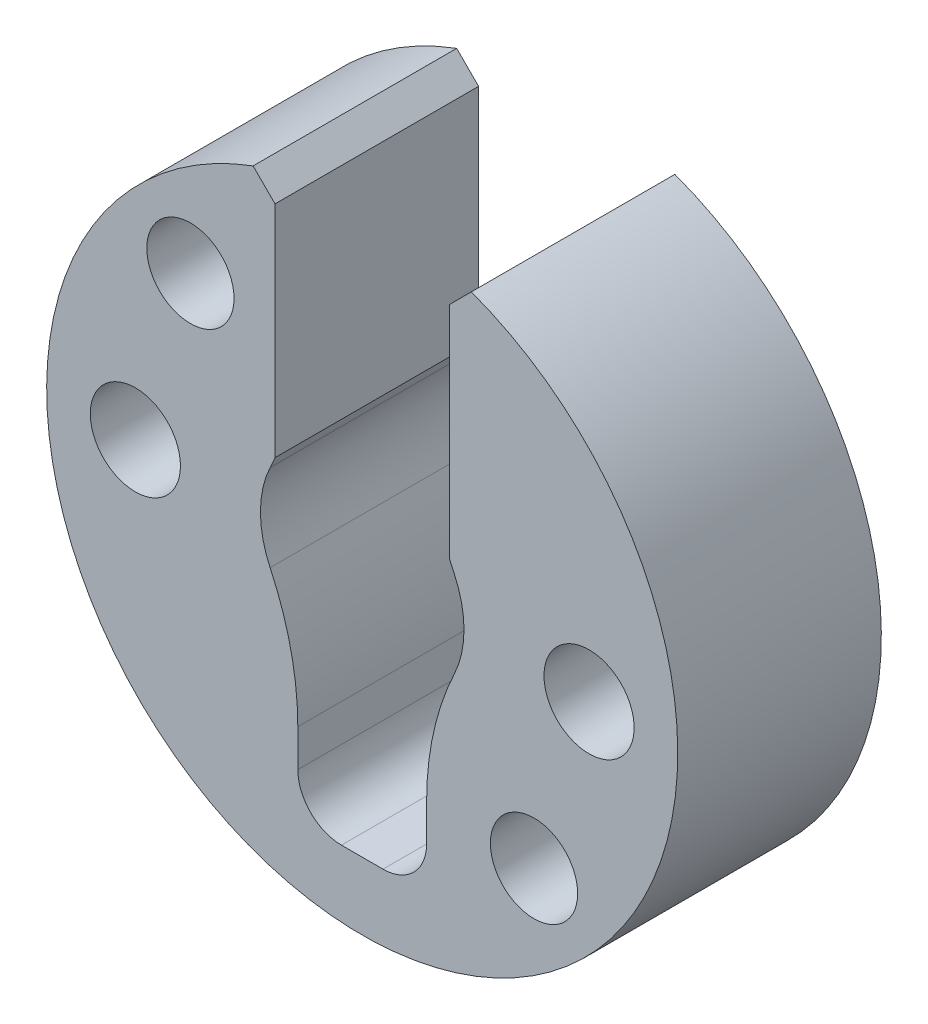
ISO-10303-21;
HEADER;
FILE_DESCRIPTION(('STEP AP214'),'2;1');
FILE_NAME('part.step','',(''),(''),'','','');
FILE_SCHEMA(('AUTOMOTIVE_DESIGN { 1 0 10303 214 1 1 1 1 }'));
ENDSEC;
DATA;
#1=APPLICATION_CONTEXT('core data for automotive mechanical design processes');
#2=APPLICATION_PROTOCOL_DEFINITION('international standard','automotive_design',2000,#1);
#3=PRODUCT_CONTEXT('',#1,'mechanical');
#4=PRODUCT('Part','Part','',(#3));
#5=PRODUCT_RELATED_PRODUCT_CATEGORY('part','',(#4));
#6=PRODUCT_DEFINITION_FORMATION('','',#4);
#7=PRODUCT_DEFINITION_CONTEXT('part definition',#1,'design');
#8=PRODUCT_DEFINITION('design','',#6,#7);
#9=PRODUCT_DEFINITION_SHAPE('','',#8);
#10=(LENGTH_UNIT() NAMED_UNIT(*) SI_UNIT(.MILLI.,.METRE.));
#11=(NAMED_UNIT(*) PLANE_ANGLE_UNIT() SI_UNIT($,.RADIAN.));
#12=(NAMED_UNIT(*) SI_UNIT($,.STERADIAN.) SOLID_ANGLE_UNIT());
#13=UNCERTAINTY_MEASURE_WITH_UNIT(LENGTH_MEASURE(1.E-05),#10,'distance_accuracy_value','');
#14=(GEOMETRIC_REPRESENTATION_CONTEXT(3) GLOBAL_UNCERTAINTY_ASSIGNED_CONTEXT((#13)) GLOBAL_UNIT_ASSIGNED_CONTEXT((#10,
#11,#12)) REPRESENTATION_CONTEXT('',''));
#15=CARTESIAN_POINT('',(0.,0.,0.));
#16=DIRECTION('',(0.,0.,1.));
#17=DIRECTION('',(1.,0.,0.));
#18=AXIS2_PLACEMENT_3D('',#15,#16,#17);
#19=CARTESIAN_POINT('',(-7.80000000000021,2.15074260103718E-13,7.));
#20=DIRECTION('',(0.,0.,-1.));
#21=DIRECTION('',(-1.,0.,0.));
#22=AXIS2_PLACEMENT_3D('',#19,#20,#21);
#23=CYLINDRICAL_SURFACE('',#22,1.55);
#24=CARTESIAN_POINT('',(-7.80000000000021,2.15074260103718E-13,7.));
#25=DIRECTION('',(0.,0.,1.));
#26=DIRECTION('',(1.,0.,0.));
#27=AXIS2_PLACEMENT_3D('',#24,#25,#26);
#28=CIRCLE('',#27,1.55);
#29=CARTESIAN_POINT('',(-6.25000000000021,2.15074260103718E-13,7.));
#30=VERTEX_POINT('',#29);
#31=EDGE_CURVE('E230',#30,#30,#28,.T.);
#32=ORIENTED_EDGE('',*,*,#31,.T.);
#33=EDGE_LOOP('',(#32));
#34=FACE_BOUND('',#33,.T.);
#35=CARTESIAN_POINT('',(-7.80000000000021,2.15074260103718E-13,2.5));
#36=DIRECTION('',(0.,0.,-1.));
#37=DIRECTION('',(-1.,0.,0.));
#38=AXIS2_PLACEMENT_3D('',#35,#36,#37);
#39=CIRCLE('',#38,1.55);
#40=CARTESIAN_POINT('',(-9.35000000000022,2.15074260103718E-13,2.5));
#41=VERTEX_POINT('',#40);
#42=EDGE_CURVE('E354',#41,#41,#39,.T.);
#43=ORIENTED_EDGE('',*,*,#42,.T.);
#44=EDGE_LOOP('',(#43));
#45=FACE_BOUND('',#44,.T.);
#46=ADVANCED_FACE('F39',(#34,#45),#23,.F.);
#47=CARTESIAN_POINT('',(7.80000000000021,2.15074260103718E-13,7.));
#48=DIRECTION('',(0.,0.,-1.));
#49=DIRECTION('',(-1.,0.,0.));
#50=AXIS2_PLACEMENT_3D('',#47,#48,#49);
#51=CYLINDRICAL_SURFACE('',#50,1.55);
#52=CARTESIAN_POINT('',(7.80000000000021,2.15074260103718E-13,7.));
#53=DIRECTION('',(0.,0.,1.));
#54=DIRECTION('',(-1.,0.,0.));
#55=AXIS2_PLACEMENT_3D('',#52,#53,#54);
#56=CIRCLE('',#55,1.55);
#57=CARTESIAN_POINT('',(6.25000000000021,2.15074260103718E-13,7.));
#58=VERTEX_POINT('',#57);
#59=EDGE_CURVE('E199',#58,#58,#56,.T.);
#60=ORIENTED_EDGE('',*,*,#59,.T.);
#61=EDGE_LOOP('',(#60));
#62=FACE_BOUND('',#61,.T.);
#63=CARTESIAN_POINT('',(7.80000000000021,2.15074260103718E-13,2.5));
#64=DIRECTION('',(0.,0.,-1.));
#65=DIRECTION('',(-1.,0.,0.));
#66=AXIS2_PLACEMENT_3D('',#63,#64,#65);
#67=CIRCLE('',#66,1.55);
#68=CARTESIAN_POINT('',(6.25000000000021,2.15074260103718E-13,2.5));
#69=VERTEX_POINT('',#68);
#70=EDGE_CURVE('E358',#69,#69,#67,.T.);
#71=ORIENTED_EDGE('',*,*,#70,.T.);
#72=EDGE_LOOP('',(#71));
#73=FACE_BOUND('',#72,.T.);
#74=ADVANCED_FACE('F436',(#62,#73),#51,.F.);
#75=CARTESIAN_POINT('',(0.,0.,7.));
#76=DIRECTION('',(0.,0.,1.));
#77=DIRECTION('',(1.,0.,0.));
#78=AXIS2_PLACEMENT_3D('',#75,#76,#77);
#79=PLANE('',#78);
#80=CARTESIAN_POINT('',(-5.90720439833731,5.90720439833729,7.));
#81=DIRECTION('',(0.,0.,1.));
#82=DIRECTION('',(1.,0.,0.));
#83=AXIS2_PLACEMENT_3D('',#80,#81,#82);
#84=CIRCLE('',#83,1.5);
#85=CARTESIAN_POINT('',(-4.40720439833731,5.90720439833729,7.));
#86=VERTEX_POINT('',#85);
#87=EDGE_CURVE('E174',#86,#86,#84,.T.);
#88=ORIENTED_EDGE('',*,*,#87,.F.);
#89=EDGE_LOOP('',(#88));
#90=FACE_BOUND('',#89,.T.);
#91=CARTESIAN_POINT('',(5.90720439833733,-5.90720439833726,7.));
#92=DIRECTION('',(0.,0.,1.));
#93=DIRECTION('',(-1.,0.,0.));
#94=AXIS2_PLACEMENT_3D('',#91,#92,#93);
#95=CIRCLE('',#94,1.5);
#96=CARTESIAN_POINT('',(4.40720439833733,-5.90720439833726,7.));
#97=VERTEX_POINT('',#96);
#98=EDGE_CURVE('E656',#97,#97,#95,.T.);
#99=ORIENTED_EDGE('',*,*,#98,.F.);
#100=EDGE_LOOP('',(#99));
#101=FACE_BOUND('',#100,.T.);
#102=CARTESIAN_POINT('',(0.,0.,7.));
#103=DIRECTION('',(0.,0.,1.));
#104=DIRECTION('',(1.,0.,0.));
#105=AXIS2_PLACEMENT_3D('',#102,#103,#104);
#106=CIRCLE('',#105,10.85);
#107=CARTESIAN_POINT('',(-3.7512584292562,10.1808919155904,7.));
#108=VERTEX_POINT('',#107);
#109=CARTESIAN_POINT('',(3.7512584292562,10.1808919155904,7.));
#110=VERTEX_POINT('',#109);
#111=EDGE_CURVE('E235',#108,#110,#106,.T.);
#112=ORIENTED_EDGE('',*,*,#111,.T.);
#113=DIRECTION('',(-0.707106781186545,-0.70710678118655,0.));
#114=VECTOR('',#113,1.);
#115=CARTESIAN_POINT('',(-3.2148167431671,3.21481674316708,7.));
#116=LINE('',#115,#114);
#117=CARTESIAN_POINT('',(2.99796111437333,9.42759460070755,7.));
#118=VERTEX_POINT('',#117);
#119=EDGE_CURVE('E171',#110,#118,#116,.T.);
#120=ORIENTED_EDGE('',*,*,#119,.T.);
#121=DIRECTION('',(0.,1.,0.));
#122=VECTOR('',#121,1.);
#123=CARTESIAN_POINT('',(2.99796111437333,0.,7.));
#124=LINE('',#123,#122);
#125=CARTESIAN_POINT('',(2.99796111437333,1.86931869307852,7.));
#126=VERTEX_POINT('',#125);
#127=EDGE_CURVE('E155',#126,#118,#124,.T.);
#128=ORIENTED_EDGE('',*,*,#127,.F.);
#129=CARTESIAN_POINT('',(12.2145602188089,5.74930592863963,7.));
#130=DIRECTION('',(0.,0.,-1.));
#131=DIRECTION('',(-1.,0.,0.));
#132=AXIS2_PLACEMENT_3D('',#129,#130,#131);
#133=CIRCLE('',#132,10.);
#134=CARTESIAN_POINT('',(3.16673783450601,1.49056079631398,7.));
#135=VERTEX_POINT('',#134);
#136=EDGE_CURVE('E170',#135,#126,#133,.T.);
#137=ORIENTED_EDGE('',*,*,#136,.F.);
#138=CARTESIAN_POINT('',(0.,0.,7.));
#139=DIRECTION('',(0.,0.,1.));
#140=DIRECTION('',(1.,0.,0.));
#141=AXIS2_PLACEMENT_3D('',#138,#139,#140);
#142=CIRCLE('',#141,3.5);
#143=CARTESIAN_POINT('',(3.16673783450601,-1.49056079631398,7.));
#144=VERTEX_POINT('',#143);
#145=EDGE_CURVE('E182',#144,#135,#142,.T.);
#146=ORIENTED_EDGE('',*,*,#145,.F.);
#147=CARTESIAN_POINT('',(12.2145602188089,-5.74930592863963,7.));
#148=DIRECTION('',(0.,0.,-1.));
#149=DIRECTION('',(-1.,0.,0.));
#150=AXIS2_PLACEMENT_3D('',#147,#148,#149);
#151=CIRCLE('',#150,10.);
#152=CARTESIAN_POINT('',(2.21456021880891,-5.74930592863963,7.));
#153=VERTEX_POINT('',#152);
#154=EDGE_CURVE('E188',#153,#144,#151,.T.);
#155=ORIENTED_EDGE('',*,*,#154,.F.);
#156=DIRECTION('',(0.,1.,0.));
#157=VECTOR('',#156,1.);
#158=CARTESIAN_POINT('',(2.21456021880891,-5.74930592863963,7.));
#159=LINE('',#158,#157);
#160=CARTESIAN_POINT('',(2.21456021880891,-7.02720331189542,7.));
#161=VERTEX_POINT('',#160);
#162=EDGE_CURVE('E384',#161,#153,#159,.T.);
#163=ORIENTED_EDGE('',*,*,#162,.F.);
#164=CARTESIAN_POINT('',(0.714560218808913,-7.02720331189542,7.));
#165=DIRECTION('',(0.,0.,1.));
#166=DIRECTION('',(-1.,0.,0.));
#167=AXIS2_PLACEMENT_3D('',#164,#165,#166);
#168=CIRCLE('',#167,1.5);
#169=CARTESIAN_POINT('',(0.714560218808913,-8.52720331189542,7.));
#170=VERTEX_POINT('',#169);
#171=EDGE_CURVE('E380',#170,#161,#168,.T.);
#172=ORIENTED_EDGE('',*,*,#171,.F.);
#173=DIRECTION('',(1.,0.,0.));
#174=VECTOR('',#173,1.);
#175=CARTESIAN_POINT('',(-0.714560218808913,-8.52720331189542,7.));
#176=LINE('',#175,#174);
#177=CARTESIAN_POINT('',(-0.714560218808912,-8.52720331189542,7.));
#178=VERTEX_POINT('',#177);
#179=EDGE_CURVE('E376',#178,#170,#176,.T.);
#180=ORIENTED_EDGE('',*,*,#179,.F.);
#181=CARTESIAN_POINT('',(-0.714560218808913,-7.02720331189542,7.));
#182=DIRECTION('',(0.,0.,1.));
#183=DIRECTION('',(-1.,0.,0.));
#184=AXIS2_PLACEMENT_3D('',#181,#182,#183);
#185=CIRCLE('',#184,1.5);
#186=CARTESIAN_POINT('',(-2.21456021880891,-7.02720331189542,7.));
#187=VERTEX_POINT('',#186);
#188=EDGE_CURVE('E372',#187,#178,#185,.T.);
#189=ORIENTED_EDGE('',*,*,#188,.F.);
#190=DIRECTION('',(0.,-1.,0.));
#191=VECTOR('',#190,1.);
#192=CARTESIAN_POINT('',(-2.21456021880891,-5.74930592863963,7.));
#193=LINE('',#192,#191);
#194=CARTESIAN_POINT('',(-2.21456021880891,-5.74930592863963,7.));
#195=VERTEX_POINT('',#194);
#196=EDGE_CURVE('E368',#195,#187,#193,.T.);
#197=ORIENTED_EDGE('',*,*,#196,.F.);
#198=CARTESIAN_POINT('',(-12.2145602188089,-5.74930592863963,7.));
#199=DIRECTION('',(0.,0.,-1.));
#200=DIRECTION('',(1.,0.,0.));
#201=AXIS2_PLACEMENT_3D('',#198,#199,#200);
#202=CIRCLE('',#201,10.);
#203=CARTESIAN_POINT('',(-3.16673783450601,-1.49056079631398,7.));
#204=VERTEX_POINT('',#203);
#205=EDGE_CURVE('E365',#204,#195,#202,.T.);
#206=ORIENTED_EDGE('',*,*,#205,.F.);
#207=CARTESIAN_POINT('',(0.,0.,7.));
#208=DIRECTION('',(0.,0.,1.));
#209=DIRECTION('',(1.,0.,0.));
#210=AXIS2_PLACEMENT_3D('',#207,#208,#209);
#211=CIRCLE('',#210,3.5);
#212=CARTESIAN_POINT('',(-3.16673783450601,1.49056079631398,7.));
#213=VERTEX_POINT('',#212);
#214=EDGE_CURVE('E186',#213,#204,#211,.T.);
#215=ORIENTED_EDGE('',*,*,#214,.F.);
#216=CARTESIAN_POINT('',(-12.2145602188089,5.74930592863962,7.));
#217=DIRECTION('',(0.,0.,-1.));
#218=DIRECTION('',(-1.,0.,0.));
#219=AXIS2_PLACEMENT_3D('',#216,#217,#218);
#220=CIRCLE('',#219,10.);
#221=CARTESIAN_POINT('',(-2.99796111437333,1.86931869307851,7.));
#222=VERTEX_POINT('',#221);
#223=EDGE_CURVE('E181',#222,#213,#220,.T.);
#224=ORIENTED_EDGE('',*,*,#223,.F.);
#225=DIRECTION('',(0.,-1.,0.));
#226=VECTOR('',#225,1.);
#227=CARTESIAN_POINT('',(-2.99796111437333,0.,7.));
#228=LINE('',#227,#226);
#229=CARTESIAN_POINT('',(-2.99796111437333,9.42759460070755,7.));
#230=VERTEX_POINT('',#229);
#231=EDGE_CURVE('E173',#230,#222,#228,.T.);
#232=ORIENTED_EDGE('',*,*,#231,.F.);
#233=DIRECTION('',(0.707106781186545,-0.70710678118655,0.));
#234=VECTOR('',#233,1.);
#235=CARTESIAN_POINT('',(3.2148167431671,3.21481674316708,7.));
#236=LINE('',#235,#234);
#237=EDGE_CURVE('E293',#230,#108,#236,.F.);
#238=ORIENTED_EDGE('',*,*,#237,.T.);
#239=EDGE_LOOP('',(#112,#120,#128,#137,#146,#155,#163,#172,#180,#189,#197,#206,#215,#224,#232,#238));
#240=FACE_BOUND('',#239,.T.);
#241=ORIENTED_EDGE('',*,*,#31,.F.);
#242=EDGE_LOOP('',(#241));
#243=FACE_BOUND('',#242,.T.);
#244=ORIENTED_EDGE('',*,*,#59,.F.);
#245=EDGE_LOOP('',(#244));
#246=FACE_BOUND('',#245,.T.);
#247=ADVANCED_FACE('F167',(#90,#101,#240,#243,#246),#79,.T.);
#248=CARTESIAN_POINT('',(0.,0.,0.));
#249=DIRECTION('',(0.,0.,1.));
#250=DIRECTION('',(1.,0.,0.));
#251=AXIS2_PLACEMENT_3D('',#248,#249,#250);
#252=PLANE('',#251);
#253=CARTESIAN_POINT('',(-5.90720439833731,5.90720439833729,0.));
#254=DIRECTION('',(0.,0.,1.));
#255=DIRECTION('',(1.,0.,0.));
#256=AXIS2_PLACEMENT_3D('',#253,#254,#255);
#257=CIRCLE('',#256,2.);
#258=CARTESIAN_POINT('',(-3.90720439833731,5.90720439833729,0.));
#259=VERTEX_POINT('',#258);
#260=EDGE_CURVE('E312',#259,#259,#257,.T.);
#261=ORIENTED_EDGE('',*,*,#260,.T.);
#262=EDGE_LOOP('',(#261));
#263=FACE_BOUND('',#262,.T.);
#264=CARTESIAN_POINT('',(5.90720439833733,-5.90720439833726,0.));
#265=DIRECTION('',(0.,0.,1.));
#266=DIRECTION('',(1.,0.,0.));
#267=AXIS2_PLACEMENT_3D('',#264,#265,#266);
#268=CIRCLE('',#267,2.);
#269=CARTESIAN_POINT('',(7.90720439833733,-5.90720439833726,0.));
#270=VERTEX_POINT('',#269);
#271=EDGE_CURVE('E308',#270,#270,#268,.T.);
#272=ORIENTED_EDGE('',*,*,#271,.T.);
#273=EDGE_LOOP('',(#272));
#274=FACE_BOUND('',#273,.T.);
#275=DIRECTION('',(0.,1.,0.));
#276=VECTOR('',#275,1.);
#277=CARTESIAN_POINT('',(2.99796111437333,0.,0.));
#278=LINE('',#277,#276);
#279=CARTESIAN_POINT('',(2.99796111437333,1.86931869307852,0.));
#280=VERTEX_POINT('',#279);
#281=CARTESIAN_POINT('',(2.99796111437333,9.42759460070755,0.));
#282=VERTEX_POINT('',#281);
#283=EDGE_CURVE('E156',#280,#282,#278,.T.);
#284=ORIENTED_EDGE('',*,*,#283,.T.);
#285=DIRECTION('',(0.707106781186545,0.70710678118655,0.));
#286=VECTOR('',#285,1.);
#287=CARTESIAN_POINT('',(3.7512584292562,10.1808919155904,0.));
#288=LINE('',#287,#286);
#289=CARTESIAN_POINT('',(3.7512584292562,10.1808919155904,0.));
#290=VERTEX_POINT('',#289);
#291=EDGE_CURVE('E302',#282,#290,#288,.T.);
#292=ORIENTED_EDGE('',*,*,#291,.T.);
#293=CARTESIAN_POINT('',(0.,0.,0.));
#294=DIRECTION('',(0.,0.,1.));
#295=DIRECTION('',(1.,0.,0.));
#296=AXIS2_PLACEMENT_3D('',#293,#294,#295);
#297=CIRCLE('',#296,10.85);
#298=CARTESIAN_POINT('',(-3.7512584292562,10.1808919155904,0.));
#299=VERTEX_POINT('',#298);
#300=EDGE_CURVE('E234',#299,#290,#297,.T.);
#301=ORIENTED_EDGE('',*,*,#300,.F.);
#302=DIRECTION('',(-0.707106781186545,0.70710678118655,0.));
#303=VECTOR('',#302,1.);
#304=CARTESIAN_POINT('',(-3.7512584292562,10.1808919155904,0.));
#305=LINE('',#304,#303);
#306=CARTESIAN_POINT('',(-2.99796111437333,9.42759460070755,0.));
#307=VERTEX_POINT('',#306);
#308=EDGE_CURVE('E55',#299,#307,#305,.F.);
#309=ORIENTED_EDGE('',*,*,#308,.T.);
#310=DIRECTION('',(0.,-1.,0.));
#311=VECTOR('',#310,1.);
#312=CARTESIAN_POINT('',(-2.99796111437333,0.,0.));
#313=LINE('',#312,#311);
#314=CARTESIAN_POINT('',(-2.99796111437333,1.86931869307851,0.));
#315=VERTEX_POINT('',#314);
#316=EDGE_CURVE('E335',#307,#315,#313,.T.);
#317=ORIENTED_EDGE('',*,*,#316,.T.);
#318=CARTESIAN_POINT('',(-12.2145602188089,5.74930592863962,0.));
#319=DIRECTION('',(0.,0.,1.));
#320=DIRECTION('',(1.,0.,0.));
#321=AXIS2_PLACEMENT_3D('',#318,#319,#320);
#322=CIRCLE('',#321,10.);
#323=CARTESIAN_POINT('',(-3.16673783450601,1.49056079631398,0.));
#324=VERTEX_POINT('',#323);
#325=EDGE_CURVE('E272',#315,#324,#322,.F.);
#326=ORIENTED_EDGE('',*,*,#325,.T.);
#327=CARTESIAN_POINT('',(0.,0.,0.));
#328=DIRECTION('',(0.,0.,1.));
#329=DIRECTION('',(1.,0.,0.));
#330=AXIS2_PLACEMENT_3D('',#327,#328,#329);
#331=CIRCLE('',#330,3.5);
#332=CARTESIAN_POINT('',(-3.16673783450601,-1.49056079631398,0.));
#333=VERTEX_POINT('',#332);
#334=EDGE_CURVE('E275',#324,#333,#331,.T.);
#335=ORIENTED_EDGE('',*,*,#334,.T.);
#336=CARTESIAN_POINT('',(-12.2145602188089,-5.74930592863963,0.));
#337=DIRECTION('',(0.,0.,1.));
#338=DIRECTION('',(1.,0.,0.));
#339=AXIS2_PLACEMENT_3D('',#336,#337,#338);
#340=CIRCLE('',#339,10.);
#341=CARTESIAN_POINT('',(-2.21456021880891,-5.74930592863963,0.));
#342=VERTEX_POINT('',#341);
#343=EDGE_CURVE('E162',#333,#342,#340,.F.);
#344=ORIENTED_EDGE('',*,*,#343,.T.);
#345=DIRECTION('',(0.,-1.,0.));
#346=VECTOR('',#345,1.);
#347=CARTESIAN_POINT('',(-2.21456021880892,0.,0.));
#348=LINE('',#347,#346);
#349=CARTESIAN_POINT('',(-2.21456021880891,-7.02720331189542,0.));
#350=VERTEX_POINT('',#349);
#351=EDGE_CURVE('E238',#342,#350,#348,.T.);
#352=ORIENTED_EDGE('',*,*,#351,.T.);
#353=CARTESIAN_POINT('',(-0.714560218808913,-7.02720331189542,0.));
#354=DIRECTION('',(0.,0.,1.));
#355=DIRECTION('',(1.,0.,0.));
#356=AXIS2_PLACEMENT_3D('',#353,#354,#355);
#357=CIRCLE('',#356,1.5);
#358=CARTESIAN_POINT('',(-0.714560218808912,-8.52720331189542,0.));
#359=VERTEX_POINT('',#358);
#360=EDGE_CURVE('E245',#350,#359,#357,.T.);
#361=ORIENTED_EDGE('',*,*,#360,.T.);
#362=DIRECTION('',(1.,0.,0.));
#363=VECTOR('',#362,1.);
#364=CARTESIAN_POINT('',(0.,-8.52720331189542,0.));
#365=LINE('',#364,#363);
#366=CARTESIAN_POINT('',(0.714560218808913,-8.52720331189542,0.));
#367=VERTEX_POINT('',#366);
#368=EDGE_CURVE('E249',#359,#367,#365,.T.);
#369=ORIENTED_EDGE('',*,*,#368,.T.);
#370=CARTESIAN_POINT('',(0.714560218808913,-7.02720331189542,0.));
#371=DIRECTION('',(0.,0.,1.));
#372=DIRECTION('',(1.,0.,0.));
#373=AXIS2_PLACEMENT_3D('',#370,#371,#372);
#374=CIRCLE('',#373,1.5);
#375=CARTESIAN_POINT('',(2.21456021880891,-7.02720331189542,0.));
#376=VERTEX_POINT('',#375);
#377=EDGE_CURVE('E253',#367,#376,#374,.T.);
#378=ORIENTED_EDGE('',*,*,#377,.T.);
#379=DIRECTION('',(0.,1.,0.));
#380=VECTOR('',#379,1.);
#381=CARTESIAN_POINT('',(2.21456021880891,0.,0.));
#382=LINE('',#381,#380);
#383=CARTESIAN_POINT('',(2.21456021880891,-5.74930592863963,0.));
#384=VERTEX_POINT('',#383);
#385=EDGE_CURVE('E257',#376,#384,#382,.T.);
#386=ORIENTED_EDGE('',*,*,#385,.T.);
#387=CARTESIAN_POINT('',(12.2145602188089,-5.74930592863963,0.));
#388=DIRECTION('',(0.,0.,1.));
#389=DIRECTION('',(1.,0.,0.));
#390=AXIS2_PLACEMENT_3D('',#387,#388,#389);
#391=CIRCLE('',#390,10.);
#392=CARTESIAN_POINT('',(3.16673783450601,-1.49056079631398,0.));
#393=VERTEX_POINT('',#392);
#394=EDGE_CURVE('E261',#384,#393,#391,.F.);
#395=ORIENTED_EDGE('',*,*,#394,.T.);
#396=CARTESIAN_POINT('',(0.,0.,0.));
#397=DIRECTION('',(0.,0.,1.));
#398=DIRECTION('',(1.,0.,0.));
#399=AXIS2_PLACEMENT_3D('',#396,#397,#398);
#400=CIRCLE('',#399,3.5);
#401=CARTESIAN_POINT('',(3.16673783450601,1.49056079631398,0.));
#402=VERTEX_POINT('',#401);
#403=EDGE_CURVE('E265',#393,#402,#400,.T.);
#404=ORIENTED_EDGE('',*,*,#403,.T.);
#405=CARTESIAN_POINT('',(12.2145602188089,5.74930592863963,0.));
#406=DIRECTION('',(0.,0.,1.));
#407=DIRECTION('',(1.,0.,0.));
#408=AXIS2_PLACEMENT_3D('',#405,#406,#407);
#409=CIRCLE('',#408,10.);
#410=EDGE_CURVE('E269',#402,#280,#409,.F.);
#411=ORIENTED_EDGE('',*,*,#410,.T.);
#412=EDGE_LOOP('',(#284,#292,#301,#309,#317,#326,#335,#344,#352,#361,#369,#378,#386,#395,#404,#411));
#413=FACE_BOUND('',#412,.T.);
#414=ADVANCED_FACE('F327',(#263,#274,#413),#252,.F.);
#415=CARTESIAN_POINT('',(0.,0.,7.));
#416=DIRECTION('',(0.,0.,-1.));
#417=DIRECTION('',(-1.,0.,0.));
#418=AXIS2_PLACEMENT_3D('',#415,#416,#417);
#419=CYLINDRICAL_SURFACE('',#418,10.85);
#420=ORIENTED_EDGE('',*,*,#300,.T.);
#421=DIRECTION('',(0.,0.,-1.));
#422=VECTOR('',#421,1.);
#423=CARTESIAN_POINT('',(3.7512584292562,10.1808919155904,7.));
#424=LINE('',#423,#422);
#425=EDGE_CURVE('E289',#290,#110,#424,.F.);
#426=ORIENTED_EDGE('',*,*,#425,.T.);
#427=ORIENTED_EDGE('',*,*,#111,.F.);
#428=DIRECTION('',(0.,0.,-1.));
#429=VECTOR('',#428,1.);
#430=CARTESIAN_POINT('',(-3.7512584292562,10.1808919155904,7.));
#431=LINE('',#430,#429);
#432=EDGE_CURVE('E285',#108,#299,#431,.T.);
#433=ORIENTED_EDGE('',*,*,#432,.T.);
#434=EDGE_LOOP('',(#420,#426,#427,#433));
#435=FACE_BOUND('',#434,.T.);
#436=ADVANCED_FACE('F330',(#435),#419,.T.);
#437=CARTESIAN_POINT('',(-12.2145602188089,-5.74930592863963,-3.));
#438=DIRECTION('',(0.,0.,1.));
#439=DIRECTION('',(1.,0.,0.));
#440=AXIS2_PLACEMENT_3D('',#437,#438,#439);
#441=CYLINDRICAL_SURFACE('',#440,10.);
#442=DIRECTION('',(0.,0.,1.));
#443=VECTOR('',#442,1.);
#444=CARTESIAN_POINT('',(-3.16673783450601,-1.49056079631398,-3.));
#445=LINE('',#444,#443);
#446=EDGE_CURVE('E196',#333,#204,#445,.T.);
#447=ORIENTED_EDGE('',*,*,#446,.T.);
#448=ORIENTED_EDGE('',*,*,#205,.T.);
#449=DIRECTION('',(0.,0.,1.));
#450=VECTOR('',#449,1.);
#451=CARTESIAN_POINT('',(-2.21456021880891,-5.74930592863963,-3.));
#452=LINE('',#451,#450);
#453=EDGE_CURVE('E195',#342,#195,#452,.T.);
#454=ORIENTED_EDGE('',*,*,#453,.F.);
#455=ORIENTED_EDGE('',*,*,#343,.F.);
#456=EDGE_LOOP('',(#447,#448,#454,#455));
#457=FACE_BOUND('',#456,.T.);
#458=ADVANCED_FACE('F419',(#457),#441,.T.);
#459=CARTESIAN_POINT('',(0.,0.,-3.));
#460=DIRECTION('',(0.,0.,1.));
#461=DIRECTION('',(1.,0.,0.));
#462=AXIS2_PLACEMENT_3D('',#459,#460,#461);
#463=CYLINDRICAL_SURFACE('',#462,3.5);
#464=DIRECTION('',(0.,0.,1.));
#465=VECTOR('',#464,1.);
#466=CARTESIAN_POINT('',(-3.16673783450601,1.49056079631398,-3.));
#467=LINE('',#466,#465);
#468=EDGE_CURVE('E200',#324,#213,#467,.T.);
#469=ORIENTED_EDGE('',*,*,#468,.T.);
#470=ORIENTED_EDGE('',*,*,#214,.T.);
#471=ORIENTED_EDGE('',*,*,#446,.F.);
#472=ORIENTED_EDGE('',*,*,#334,.F.);
#473=EDGE_LOOP('',(#469,#470,#471,#472));
#474=FACE_BOUND('',#473,.T.);
#475=ADVANCED_FACE('F424',(#474),#463,.F.);
#476=CARTESIAN_POINT('',(-12.2145602188089,5.74930592863962,-3.));
#477=DIRECTION('',(0.,0.,1.));
#478=DIRECTION('',(1.,0.,0.));
#479=AXIS2_PLACEMENT_3D('',#476,#477,#478);
#480=CYLINDRICAL_SURFACE('',#479,10.);
#481=ORIENTED_EDGE('',*,*,#325,.F.);
#482=DIRECTION('',(0.,0.,1.));
#483=VECTOR('',#482,1.);
#484=CARTESIAN_POINT('',(-2.99796111437333,1.86931869307851,-3.));
#485=LINE('',#484,#483);
#486=EDGE_CURVE('E161',#315,#222,#485,.T.);
#487=ORIENTED_EDGE('',*,*,#486,.T.);
#488=ORIENTED_EDGE('',*,*,#223,.T.);
#489=ORIENTED_EDGE('',*,*,#468,.F.);
#490=EDGE_LOOP('',(#481,#487,#488,#489));
#491=FACE_BOUND('',#490,.T.);
#492=ADVANCED_FACE('F426',(#491),#480,.T.);
#493=CARTESIAN_POINT('',(12.2145602188089,5.74930592863963,-3.));
#494=DIRECTION('',(0.,0.,1.));
#495=DIRECTION('',(1.,0.,0.));
#496=AXIS2_PLACEMENT_3D('',#493,#494,#495);
#497=CYLINDRICAL_SURFACE('',#496,10.);
#498=ORIENTED_EDGE('',*,*,#136,.T.);
#499=DIRECTION('',(0.,0.,1.));
#500=VECTOR('',#499,1.);
#501=CARTESIAN_POINT('',(2.99796111437333,1.86931869307852,-3.));
#502=LINE('',#501,#500);
#503=EDGE_CURVE('E152',#126,#280,#502,.F.);
#504=ORIENTED_EDGE('',*,*,#503,.T.);
#505=ORIENTED_EDGE('',*,*,#410,.F.);
#506=DIRECTION('',(0.,0.,1.));
#507=VECTOR('',#506,1.);
#508=CARTESIAN_POINT('',(3.16673783450601,1.49056079631398,-3.));
#509=LINE('',#508,#507);
#510=EDGE_CURVE('E178',#402,#135,#509,.T.);
#511=ORIENTED_EDGE('',*,*,#510,.T.);
#512=EDGE_LOOP('',(#498,#504,#505,#511));
#513=FACE_BOUND('',#512,.T.);
#514=ADVANCED_FACE('F176',(#513),#497,.T.);
#515=CARTESIAN_POINT('',(0.,0.,-3.));
#516=DIRECTION('',(0.,0.,1.));
#517=DIRECTION('',(1.,0.,0.));
#518=AXIS2_PLACEMENT_3D('',#515,#516,#517);
#519=CYLINDRICAL_SURFACE('',#518,3.5);
#520=DIRECTION('',(0.,0.,1.));
#521=VECTOR('',#520,1.);
#522=CARTESIAN_POINT('',(3.16673783450601,-1.49056079631398,-3.));
#523=LINE('',#522,#521);
#524=EDGE_CURVE('E206',#393,#144,#523,.T.);
#525=ORIENTED_EDGE('',*,*,#524,.T.);
#526=ORIENTED_EDGE('',*,*,#145,.T.);
#527=ORIENTED_EDGE('',*,*,#510,.F.);
#528=ORIENTED_EDGE('',*,*,#403,.F.);
#529=EDGE_LOOP('',(#525,#526,#527,#528));
#530=FACE_BOUND('',#529,.T.);
#531=ADVANCED_FACE('F396',(#530),#519,.F.);
#532=CARTESIAN_POINT('',(12.2145602188089,-5.74930592863963,-3.));
#533=DIRECTION('',(0.,0.,1.));
#534=DIRECTION('',(1.,0.,0.));
#535=AXIS2_PLACEMENT_3D('',#532,#533,#534);
#536=CYLINDRICAL_SURFACE('',#535,10.);
#537=DIRECTION('',(0.,0.,1.));
#538=VECTOR('',#537,1.);
#539=CARTESIAN_POINT('',(2.21456021880891,-5.74930592863963,-3.));
#540=LINE('',#539,#538);
#541=EDGE_CURVE('E209',#384,#153,#540,.T.);
#542=ORIENTED_EDGE('',*,*,#541,.T.);
#543=ORIENTED_EDGE('',*,*,#154,.T.);
#544=ORIENTED_EDGE('',*,*,#524,.F.);
#545=ORIENTED_EDGE('',*,*,#394,.F.);
#546=EDGE_LOOP('',(#542,#543,#544,#545));
#547=FACE_BOUND('',#546,.T.);
#548=ADVANCED_FACE('F392',(#547),#536,.T.);
#549=CARTESIAN_POINT('',(2.21456021880891,-5.74930592863963,-3.));
#550=DIRECTION('',(1.,0.,0.));
#551=DIRECTION('',(0.,0.,-1.));
#552=AXIS2_PLACEMENT_3D('',#549,#550,#551);
#553=PLANE('',#552);
#554=DIRECTION('',(0.,0.,1.));
#555=VECTOR('',#554,1.);
#556=CARTESIAN_POINT('',(2.21456021880891,-7.02720331189542,-3.));
#557=LINE('',#556,#555);
#558=EDGE_CURVE('E212',#376,#161,#557,.T.);
#559=ORIENTED_EDGE('',*,*,#558,.T.);
#560=ORIENTED_EDGE('',*,*,#162,.T.);
#561=ORIENTED_EDGE('',*,*,#541,.F.);
#562=ORIENTED_EDGE('',*,*,#385,.F.);
#563=EDGE_LOOP('',(#559,#560,#561,#562));
#564=FACE_BOUND('',#563,.T.);
#565=ADVANCED_FACE('F398',(#564),#553,.F.);
#566=CARTESIAN_POINT('',(0.714560218808913,-7.02720331189542,-3.));
#567=DIRECTION('',(0.,0.,1.));
#568=DIRECTION('',(1.,0.,0.));
#569=AXIS2_PLACEMENT_3D('',#566,#567,#568);
#570=CYLINDRICAL_SURFACE('',#569,1.5);
#571=DIRECTION('',(0.,0.,1.));
#572=VECTOR('',#571,1.);
#573=CARTESIAN_POINT('',(0.714560218808913,-8.52720331189542,-3.));
#574=LINE('',#573,#572);
#575=EDGE_CURVE('E215',#367,#170,#574,.T.);
#576=ORIENTED_EDGE('',*,*,#575,.T.);
#577=ORIENTED_EDGE('',*,*,#171,.T.);
#578=ORIENTED_EDGE('',*,*,#558,.F.);
#579=ORIENTED_EDGE('',*,*,#377,.F.);
#580=EDGE_LOOP('',(#576,#577,#578,#579));
#581=FACE_BOUND('',#580,.T.);
#582=ADVANCED_FACE('F404',(#581),#570,.F.);
#583=CARTESIAN_POINT('',(-0.714560218808913,-8.52720331189542,-3.));
#584=DIRECTION('',(0.,-1.,0.));
#585=DIRECTION('',(0.,0.,-1.));
#586=AXIS2_PLACEMENT_3D('',#583,#584,#585);
#587=PLANE('',#586);
#588=DIRECTION('',(0.,0.,1.));
#589=VECTOR('',#588,1.);
#590=CARTESIAN_POINT('',(-0.714560218808912,-8.52720331189542,-3.));
#591=LINE('',#590,#589);
#592=EDGE_CURVE('E218',#359,#178,#591,.T.);
#593=ORIENTED_EDGE('',*,*,#592,.T.);
#594=ORIENTED_EDGE('',*,*,#179,.T.);
#595=ORIENTED_EDGE('',*,*,#575,.F.);
#596=ORIENTED_EDGE('',*,*,#368,.F.);
#597=EDGE_LOOP('',(#593,#594,#595,#596));
#598=FACE_BOUND('',#597,.T.);
#599=ADVANCED_FACE('F407',(#598),#587,.F.);
#600=CARTESIAN_POINT('',(-0.714560218808913,-7.02720331189542,-3.));
#601=DIRECTION('',(0.,0.,1.));
#602=DIRECTION('',(1.,0.,0.));
#603=AXIS2_PLACEMENT_3D('',#600,#601,#602);
#604=CYLINDRICAL_SURFACE('',#603,1.5);
#605=DIRECTION('',(0.,0.,1.));
#606=VECTOR('',#605,1.);
#607=CARTESIAN_POINT('',(-2.21456021880891,-7.02720331189542,-3.));
#608=LINE('',#607,#606);
#609=EDGE_CURVE('E221',#350,#187,#608,.T.);
#610=ORIENTED_EDGE('',*,*,#609,.T.);
#611=ORIENTED_EDGE('',*,*,#188,.T.);
#612=ORIENTED_EDGE('',*,*,#592,.F.);
#613=ORIENTED_EDGE('',*,*,#360,.F.);
#614=EDGE_LOOP('',(#610,#611,#612,#613));
#615=FACE_BOUND('',#614,.T.);
#616=ADVANCED_FACE('F411',(#615),#604,.F.);
#617=CARTESIAN_POINT('',(-2.21456021880891,-5.74930592863963,-3.));
#618=DIRECTION('',(-1.,0.,0.));
#619=DIRECTION('',(0.,-1.,0.));
#620=AXIS2_PLACEMENT_3D('',#617,#618,#619);
#621=PLANE('',#620);
#622=ORIENTED_EDGE('',*,*,#453,.T.);
#623=ORIENTED_EDGE('',*,*,#196,.T.);
#624=ORIENTED_EDGE('',*,*,#609,.F.);
#625=ORIENTED_EDGE('',*,*,#351,.F.);
#626=EDGE_LOOP('',(#622,#623,#624,#625));
#627=FACE_BOUND('',#626,.T.);
#628=ADVANCED_FACE('F416',(#627),#621,.F.);
#629=CARTESIAN_POINT('',(7.80000000000021,2.15074260103718E-13,2.5));
#630=DIRECTION('',(0.,0.,-1.));
#631=DIRECTION('',(-1.,0.,0.));
#632=AXIS2_PLACEMENT_3D('',#629,#630,#631);
#633=PLANE('',#632);
#634=ORIENTED_EDGE('',*,*,#70,.F.);
#635=EDGE_LOOP('',(#634));
#636=FACE_BOUND('',#635,.T.);
#637=ADVANCED_FACE('F474',(#636),#633,.F.);
#638=CARTESIAN_POINT('',(-7.80000000000021,2.15074260103718E-13,2.5));
#639=DIRECTION('',(0.,0.,-1.));
#640=DIRECTION('',(-1.,0.,0.));
#641=AXIS2_PLACEMENT_3D('',#638,#639,#640);
#642=PLANE('',#641);
#643=ORIENTED_EDGE('',*,*,#42,.F.);
#644=EDGE_LOOP('',(#643));
#645=FACE_BOUND('',#644,.T.);
#646=ADVANCED_FACE('F471',(#645),#642,.F.);
#647=CARTESIAN_POINT('',(2.99796111437333,0.,-4.5));
#648=DIRECTION('',(1.,0.,0.));
#649=DIRECTION('',(0.,0.,-1.));
#650=AXIS2_PLACEMENT_3D('',#647,#648,#649);
#651=PLANE('',#650);
#652=ORIENTED_EDGE('',*,*,#127,.T.);
#653=DIRECTION('',(0.,0.,-1.));
#654=VECTOR('',#653,1.);
#655=CARTESIAN_POINT('',(2.99796111437333,9.42759460070755,-4.5));
#656=LINE('',#655,#654);
#657=EDGE_CURVE('E63',#118,#282,#656,.T.);
#658=ORIENTED_EDGE('',*,*,#657,.T.);
#659=ORIENTED_EDGE('',*,*,#283,.F.);
#660=ORIENTED_EDGE('',*,*,#503,.F.);
#661=EDGE_LOOP('',(#652,#658,#659,#660));
#662=FACE_BOUND('',#661,.T.);
#663=ADVANCED_FACE('F154',(#662),#651,.F.);
#664=CARTESIAN_POINT('',(-2.99796111437333,0.,-4.5));
#665=DIRECTION('',(-1.,0.,0.));
#666=DIRECTION('',(0.,0.,1.));
#667=AXIS2_PLACEMENT_3D('',#664,#665,#666);
#668=PLANE('',#667);
#669=ORIENTED_EDGE('',*,*,#316,.F.);
#670=DIRECTION('',(0.,0.,1.));
#671=VECTOR('',#670,1.);
#672=CARTESIAN_POINT('',(-2.99796111437333,9.42759460070755,-4.5));
#673=LINE('',#672,#671);
#674=EDGE_CURVE('E305',#307,#230,#673,.T.);
#675=ORIENTED_EDGE('',*,*,#674,.T.);
#676=ORIENTED_EDGE('',*,*,#231,.T.);
#677=ORIENTED_EDGE('',*,*,#486,.F.);
#678=EDGE_LOOP('',(#669,#675,#676,#677));
#679=FACE_BOUND('',#678,.T.);
#680=ADVANCED_FACE('F350',(#679),#668,.F.);
#681=CARTESIAN_POINT('',(3.7512584292562,10.1808919155904,7.));
#682=DIRECTION('',(-0.70710678118655,0.707106781186545,0.));
#683=DIRECTION('',(0.,0.,-1.));
#684=AXIS2_PLACEMENT_3D('',#681,#682,#683);
#685=PLANE('',#684);
#686=ORIENTED_EDGE('',*,*,#291,.F.);
#687=ORIENTED_EDGE('',*,*,#657,.F.);
#688=ORIENTED_EDGE('',*,*,#119,.F.);
#689=ORIENTED_EDGE('',*,*,#425,.F.);
#690=EDGE_LOOP('',(#686,#687,#688,#689));
#691=FACE_BOUND('',#690,.T.);
#692=ADVANCED_FACE('F339',(#691),#685,.T.);
#693=CARTESIAN_POINT('',(-3.7512584292562,10.1808919155904,7.));
#694=DIRECTION('',(-0.70710678118655,-0.707106781186545,0.));
#695=DIRECTION('',(0.,0.,-1.));
#696=AXIS2_PLACEMENT_3D('',#693,#694,#695);
#697=PLANE('',#696);
#698=ORIENTED_EDGE('',*,*,#237,.F.);
#699=ORIENTED_EDGE('',*,*,#674,.F.);
#700=ORIENTED_EDGE('',*,*,#308,.F.);
#701=ORIENTED_EDGE('',*,*,#432,.F.);
#702=EDGE_LOOP('',(#698,#699,#700,#701));
#703=FACE_BOUND('',#702,.T.);
#704=ADVANCED_FACE('F348',(#703),#697,.F.);
#705=CARTESIAN_POINT('',(5.90720439833733,-5.90720439833726,-4.5));
#706=DIRECTION('',(0.,0.,1.));
#707=DIRECTION('',(1.,0.,0.));
#708=AXIS2_PLACEMENT_3D('',#705,#706,#707);
#709=CYLINDRICAL_SURFACE('',#708,1.5);
#710=CARTESIAN_POINT('',(5.90720439833733,-5.90720439833726,0.500000000000005));
#711=DIRECTION('',(0.,0.,1.));
#712=DIRECTION('',(1.,0.,0.));
#713=AXIS2_PLACEMENT_3D('',#710,#711,#712);
#714=CIRCLE('',#713,1.5);
#715=CARTESIAN_POINT('',(7.40720439833733,-5.90720439833726,0.500000000000005));
#716=VERTEX_POINT('',#715);
#717=EDGE_CURVE('E11',#716,#716,#714,.F.);
#718=ORIENTED_EDGE('',*,*,#717,.T.);
#719=EDGE_LOOP('',(#718));
#720=FACE_BOUND('',#719,.T.);
#721=ORIENTED_EDGE('',*,*,#98,.T.);
#722=EDGE_LOOP('',(#721));
#723=FACE_BOUND('',#722,.T.);
#724=ADVANCED_FACE('F455',(#720,#723),#709,.F.);
#725=CARTESIAN_POINT('',(-5.90720439833731,5.90720439833729,-4.5));
#726=DIRECTION('',(0.,0.,1.));
#727=DIRECTION('',(1.,0.,0.));
#728=AXIS2_PLACEMENT_3D('',#725,#726,#727);
#729=CYLINDRICAL_SURFACE('',#728,1.5);
#730=CARTESIAN_POINT('',(-5.90720439833731,5.90720439833729,0.500000000000004));
#731=DIRECTION('',(0.,0.,1.));
#732=DIRECTION('',(1.,0.,0.));
#733=AXIS2_PLACEMENT_3D('',#730,#731,#732);
#734=CIRCLE('',#733,1.5);
#735=CARTESIAN_POINT('',(-4.40720439833731,5.90720439833729,0.500000000000004));
#736=VERTEX_POINT('',#735);
#737=EDGE_CURVE('E48',#736,#736,#734,.F.);
#738=ORIENTED_EDGE('',*,*,#737,.T.);
#739=EDGE_LOOP('',(#738));
#740=FACE_BOUND('',#739,.T.);
#741=ORIENTED_EDGE('',*,*,#87,.T.);
#742=EDGE_LOOP('',(#741));
#743=FACE_BOUND('',#742,.T.);
#744=ADVANCED_FACE('F319',(#740,#743),#729,.F.);
#745=CARTESIAN_POINT('',(-5.90720439833731,5.90720439833729,0.));
#746=DIRECTION('',(0.,0.,-1.));
#747=DIRECTION('',(-1.,0.,0.));
#748=AXIS2_PLACEMENT_3D('',#745,#746,#747);
#749=CONICAL_SURFACE('',#748,2.,0.785398163397443);
#750=ORIENTED_EDGE('',*,*,#737,.F.);
#751=EDGE_LOOP('',(#750));
#752=FACE_BOUND('',#751,.T.);
#753=ORIENTED_EDGE('',*,*,#260,.F.);
#754=EDGE_LOOP('',(#753));
#755=FACE_BOUND('',#754,.T.);
#756=ADVANCED_FACE('F322',(#752,#755),#749,.F.);
#757=CARTESIAN_POINT('',(5.90720439833733,-5.90720439833726,0.));
#758=DIRECTION('',(0.,0.,-1.));
#759=DIRECTION('',(-1.,0.,0.));
#760=AXIS2_PLACEMENT_3D('',#757,#758,#759);
#761=CONICAL_SURFACE('',#760,2.,0.785398163397443);
#762=ORIENTED_EDGE('',*,*,#717,.F.);
#763=EDGE_LOOP('',(#762));
#764=FACE_BOUND('',#763,.T.);
#765=ORIENTED_EDGE('',*,*,#271,.F.);
#766=EDGE_LOOP('',(#765));
#767=FACE_BOUND('',#766,.T.);
#768=ADVANCED_FACE('F41',(#764,#767),#761,.F.);
#769=CLOSED_SHELL('',(#46,#74,#247,#414,#436,#458,#475,#492,#514,#531,#548,#565,#582,#599,#616,
#628,#637,#646,#663,#680,#692,#704,#724,#744,#756,#768));
#770=MANIFOLD_SOLID_BREP('B2',#769);
#771=ADVANCED_BREP_SHAPE_REPRESENTATION('',(#18,#770),#14);
#772=SHAPE_DEFINITION_REPRESENTATION(#9,#771);
ENDSEC;
END-ISO-10303-21;
